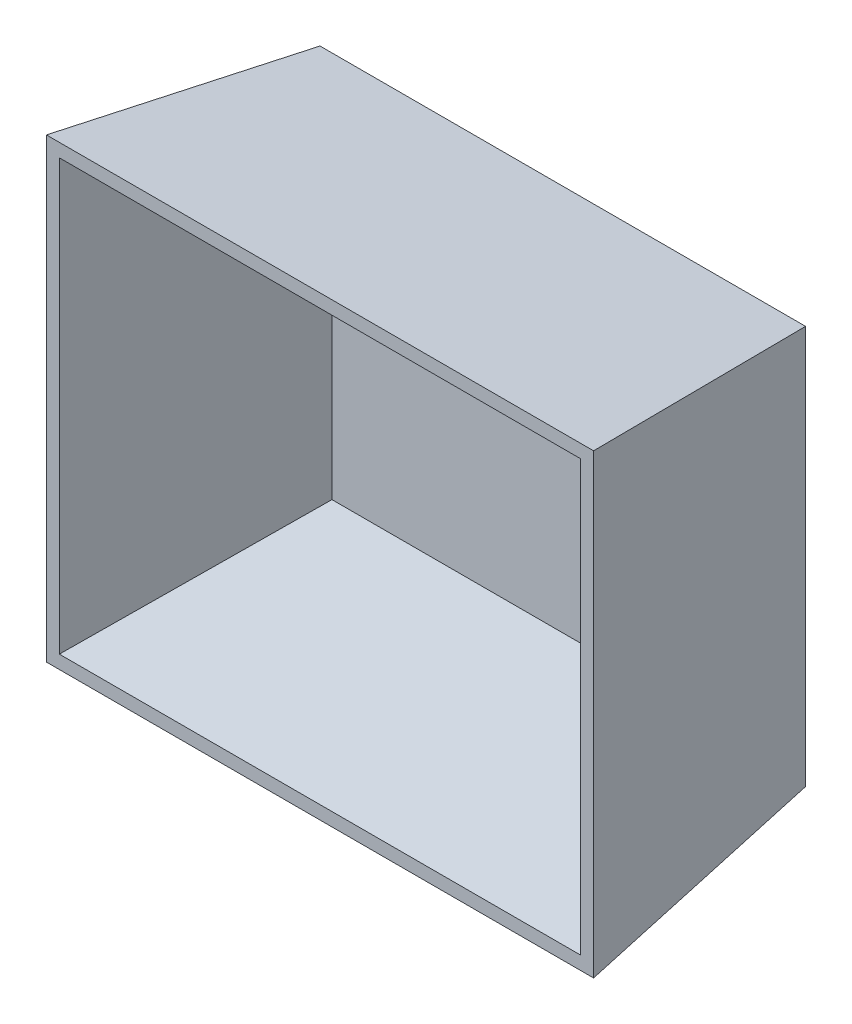
ISO-10303-21;
HEADER;
FILE_DESCRIPTION(('STEP AP214'),'2;1');
FILE_NAME('part.step','',(''),(''),'','','');
FILE_SCHEMA(('AUTOMOTIVE_DESIGN { 1 0 10303 214 1 1 1 1 }'));
ENDSEC;
DATA;
#1=APPLICATION_CONTEXT('core data for automotive mechanical design processes');
#2=APPLICATION_PROTOCOL_DEFINITION('international standard','automotive_design',2000,#1);
#3=PRODUCT_CONTEXT('',#1,'mechanical');
#4=PRODUCT('Part','Part','',(#3));
#5=PRODUCT_RELATED_PRODUCT_CATEGORY('part','',(#4));
#6=PRODUCT_DEFINITION_FORMATION('','',#4);
#7=PRODUCT_DEFINITION_CONTEXT('part definition',#1,'design');
#8=PRODUCT_DEFINITION('design','',#6,#7);
#9=PRODUCT_DEFINITION_SHAPE('','',#8);
#10=(LENGTH_UNIT() NAMED_UNIT(*) SI_UNIT(.MILLI.,.METRE.));
#11=(NAMED_UNIT(*) PLANE_ANGLE_UNIT() SI_UNIT($,.RADIAN.));
#12=(NAMED_UNIT(*) SI_UNIT($,.STERADIAN.) SOLID_ANGLE_UNIT());
#13=UNCERTAINTY_MEASURE_WITH_UNIT(LENGTH_MEASURE(1.E-05),#10,'distance_accuracy_value','');
#14=(GEOMETRIC_REPRESENTATION_CONTEXT(3) GLOBAL_UNCERTAINTY_ASSIGNED_CONTEXT((#13)) GLOBAL_UNIT_ASSIGNED_CONTEXT((#10,
#11,#12)) REPRESENTATION_CONTEXT('',''));
#15=CARTESIAN_POINT('',(0.,0.,0.));
#16=DIRECTION('',(0.,0.,1.));
#17=DIRECTION('',(1.,0.,0.));
#18=AXIS2_PLACEMENT_3D('',#15,#16,#17);
#19=CARTESIAN_POINT('',(0.,0.,67.));
#20=DIRECTION('',(0.,0.,-1.));
#21=DIRECTION('',(-1.,0.,0.));
#22=AXIS2_PLACEMENT_3D('',#19,#20,#21);
#23=PLANE('',#22);
#24=DIRECTION('',(0.,1.,0.));
#25=VECTOR('',#24,1.);
#26=CARTESIAN_POINT('',(142.5,-8.,67.));
#27=LINE('',#26,#25);
#28=CARTESIAN_POINT('',(142.5,-8.,67.));
#29=VERTEX_POINT('',#28);
#30=CARTESIAN_POINT('',(142.5,118.,67.));
#31=VERTEX_POINT('',#30);
#32=EDGE_CURVE('E312',#29,#31,#27,.T.);
#33=ORIENTED_EDGE('',*,*,#32,.T.);
#34=DIRECTION('',(-1.,0.,0.));
#35=VECTOR('',#34,1.);
#36=CARTESIAN_POINT('',(-8.50000000000001,118.,67.));
#37=LINE('',#36,#35);
#38=CARTESIAN_POINT('',(-8.50000000000001,118.,67.));
#39=VERTEX_POINT('',#38);
#40=EDGE_CURVE('E215',#31,#39,#37,.T.);
#41=ORIENTED_EDGE('',*,*,#40,.T.);
#42=DIRECTION('',(0.,-1.,0.));
#43=VECTOR('',#42,1.);
#44=CARTESIAN_POINT('',(-8.50000000000001,-7.99999999999997,67.));
#45=LINE('',#44,#43);
#46=CARTESIAN_POINT('',(-8.50000000000001,-7.99999999999997,67.));
#47=VERTEX_POINT('',#46);
#48=EDGE_CURVE('E200',#39,#47,#45,.T.);
#49=ORIENTED_EDGE('',*,*,#48,.T.);
#50=DIRECTION('',(1.,0.,0.));
#51=VECTOR('',#50,1.);
#52=CARTESIAN_POINT('',(-8.50000000000001,-7.99999999999997,67.));
#53=LINE('',#52,#51);
#54=EDGE_CURVE('E205',#47,#29,#53,.T.);
#55=ORIENTED_EDGE('',*,*,#54,.T.);
#56=EDGE_LOOP('',(#33,#41,#49,#55));
#57=FACE_BOUND('',#56,.T.);
#58=DIRECTION('',(0.,-1.,0.));
#59=VECTOR('',#58,1.);
#60=CARTESIAN_POINT('',(-4.93785539788666,-4.31363355955421,67.));
#61=LINE('',#60,#59);
#62=CARTESIAN_POINT('',(-4.93785539788666,114.313633559554,67.));
#63=VERTEX_POINT('',#62);
#64=CARTESIAN_POINT('',(-4.93785539788666,-4.31363355955421,67.));
#65=VERTEX_POINT('',#64);
#66=EDGE_CURVE('E139',#63,#65,#61,.T.);
#67=ORIENTED_EDGE('',*,*,#66,.F.);
#68=DIRECTION('',(-1.,0.,0.));
#69=VECTOR('',#68,1.);
#70=CARTESIAN_POINT('',(-4.93785539788666,114.313633559554,67.));
#71=LINE('',#70,#69);
#72=CARTESIAN_POINT('',(138.937855397887,114.313633559554,67.));
#73=VERTEX_POINT('',#72);
#74=EDGE_CURVE('E144',#73,#63,#71,.T.);
#75=ORIENTED_EDGE('',*,*,#74,.F.);
#76=DIRECTION('',(0.,1.,0.));
#77=VECTOR('',#76,1.);
#78=CARTESIAN_POINT('',(138.937855397887,-4.31363355955421,67.));
#79=LINE('',#78,#77);
#80=CARTESIAN_POINT('',(138.937855397887,-4.31363355955421,67.));
#81=VERTEX_POINT('',#80);
#82=EDGE_CURVE('E145',#81,#73,#79,.T.);
#83=ORIENTED_EDGE('',*,*,#82,.F.);
#84=DIRECTION('',(1.,0.,0.));
#85=VECTOR('',#84,1.);
#86=CARTESIAN_POINT('',(-4.93785539788666,-4.31363355955421,67.));
#87=LINE('',#86,#85);
#88=EDGE_CURVE('E129',#65,#81,#87,.T.);
#89=ORIENTED_EDGE('',*,*,#88,.F.);
#90=EDGE_LOOP('',(#67,#75,#83,#89));
#91=FACE_BOUND('',#90,.T.);
#92=ADVANCED_FACE('F55',(#57,#91),#23,.F.);
#93=CARTESIAN_POINT('',(0.,0.,0.));
#94=DIRECTION('',(0.,0.,-1.));
#95=DIRECTION('',(-1.,0.,0.));
#96=AXIS2_PLACEMENT_3D('',#93,#94,#95);
#97=PLANE('',#96);
#98=DIRECTION('',(0.,-1.,0.));
#99=VECTOR('',#98,1.);
#100=CARTESIAN_POINT('',(0.,0.,0.));
#101=LINE('',#100,#99);
#102=CARTESIAN_POINT('',(0.,110.,0.));
#103=VERTEX_POINT('',#102);
#104=CARTESIAN_POINT('',(0.,0.,0.));
#105=VERTEX_POINT('',#104);
#106=EDGE_CURVE('E170',#103,#105,#101,.T.);
#107=ORIENTED_EDGE('',*,*,#106,.F.);
#108=DIRECTION('',(-1.,0.,0.));
#109=VECTOR('',#108,1.);
#110=CARTESIAN_POINT('',(0.,110.,0.));
#111=LINE('',#110,#109);
#112=CARTESIAN_POINT('',(134.,110.,0.));
#113=VERTEX_POINT('',#112);
#114=EDGE_CURVE('E171',#113,#103,#111,.T.);
#115=ORIENTED_EDGE('',*,*,#114,.F.);
#116=DIRECTION('',(0.,1.,0.));
#117=VECTOR('',#116,1.);
#118=CARTESIAN_POINT('',(134.,0.,0.));
#119=LINE('',#118,#117);
#120=CARTESIAN_POINT('',(134.,0.,0.));
#121=VERTEX_POINT('',#120);
#122=EDGE_CURVE('E65',#121,#113,#119,.T.);
#123=ORIENTED_EDGE('',*,*,#122,.F.);
#124=DIRECTION('',(1.,0.,0.));
#125=VECTOR('',#124,1.);
#126=CARTESIAN_POINT('',(0.,0.,0.));
#127=LINE('',#126,#125);
#128=EDGE_CURVE('E12',#105,#121,#127,.T.);
#129=ORIENTED_EDGE('',*,*,#128,.F.);
#130=EDGE_LOOP('',(#107,#115,#123,#129));
#131=FACE_BOUND('',#130,.T.);
#132=ADVANCED_FACE('F57',(#131),#97,.T.);
#133=CARTESIAN_POINT('',(0.,108.4537667472,-12.9497034922029));
#134=DIRECTION('',(0.,0.992946793169428,-0.118560811124708));
#135=DIRECTION('',(0.,0.118560811124708,0.992946793169428));
#136=AXIS2_PLACEMENT_3D('',#133,#134,#135);
#137=PLANE('',#136);
#138=DIRECTION('',(-0.124983107879759,-0.11763116035742,-0.985160967993395));
#139=VECTOR('',#138,1.);
#140=CARTESIAN_POINT('',(142.5,118.,67.));
#141=LINE('',#140,#139);
#142=EDGE_CURVE('E192',#31,#113,#141,.T.);
#143=ORIENTED_EDGE('',*,*,#142,.T.);
#144=ORIENTED_EDGE('',*,*,#114,.T.);
#145=DIRECTION('',(0.124983107879759,-0.11763116035742,-0.985160967993395));
#146=VECTOR('',#145,1.);
#147=CARTESIAN_POINT('',(-8.50000000000001,118.,67.));
#148=LINE('',#147,#146);
#149=EDGE_CURVE('E189',#39,#103,#148,.T.);
#150=ORIENTED_EDGE('',*,*,#149,.F.);
#151=ORIENTED_EDGE('',*,*,#40,.F.);
#152=EDGE_LOOP('',(#143,#144,#150,#151));
#153=FACE_BOUND('',#152,.T.);
#154=ADVANCED_FACE('F188',(#153),#137,.T.);
#155=CARTESIAN_POINT('',(0.,0.,0.));
#156=DIRECTION('',(-0.992048408016277,0.,-0.125856887584155));
#157=DIRECTION('',(-0.125856887584155,0.,0.992048408016277));
#158=AXIS2_PLACEMENT_3D('',#155,#156,#157);
#159=PLANE('',#158);
#160=ORIENTED_EDGE('',*,*,#149,.T.);
#161=ORIENTED_EDGE('',*,*,#106,.T.);
#162=DIRECTION('',(0.124983107879759,0.11763116035742,-0.985160967993395));
#163=VECTOR('',#162,1.);
#164=CARTESIAN_POINT('',(-8.50000000000001,-7.99999999999997,67.));
#165=LINE('',#164,#163);
#166=EDGE_CURVE('E203',#47,#105,#165,.T.);
#167=ORIENTED_EDGE('',*,*,#166,.F.);
#168=ORIENTED_EDGE('',*,*,#48,.F.);
#169=EDGE_LOOP('',(#160,#161,#167,#168));
#170=FACE_BOUND('',#169,.T.);
#171=ADVANCED_FACE('F196',(#170),#159,.T.);
#172=CARTESIAN_POINT('',(131.877445875582,0.,-16.7307207454097));
#173=DIRECTION('',(0.992048408016277,0.,-0.125856887584154));
#174=DIRECTION('',(-0.125856887584154,0.,-0.992048408016277));
#175=AXIS2_PLACEMENT_3D('',#172,#173,#174);
#176=PLANE('',#175);
#177=DIRECTION('',(-0.124983107879759,0.11763116035742,-0.985160967993395));
#178=VECTOR('',#177,1.);
#179=CARTESIAN_POINT('',(142.5,-8.,67.));
#180=LINE('',#179,#178);
#181=EDGE_CURVE('E81',#29,#121,#180,.T.);
#182=ORIENTED_EDGE('',*,*,#181,.T.);
#183=ORIENTED_EDGE('',*,*,#122,.T.);
#184=ORIENTED_EDGE('',*,*,#142,.F.);
#185=ORIENTED_EDGE('',*,*,#32,.F.);
#186=EDGE_LOOP('',(#182,#183,#184,#185));
#187=FACE_BOUND('',#186,.T.);
#188=ADVANCED_FACE('F247',(#187),#176,.T.);
#189=CARTESIAN_POINT('',(0.,0.,0.));
#190=DIRECTION('',(0.,-0.992946793169428,-0.118560811124707));
#191=DIRECTION('',(0.,0.118560811124707,-0.992946793169428));
#192=AXIS2_PLACEMENT_3D('',#189,#190,#191);
#193=PLANE('',#192);
#194=ORIENTED_EDGE('',*,*,#166,.T.);
#195=ORIENTED_EDGE('',*,*,#128,.T.);
#196=ORIENTED_EDGE('',*,*,#181,.F.);
#197=ORIENTED_EDGE('',*,*,#54,.F.);
#198=EDGE_LOOP('',(#194,#195,#196,#197));
#199=FACE_BOUND('',#198,.T.);
#200=ADVANCED_FACE('F255',(#199),#193,.T.);
#201=CARTESIAN_POINT('',(0.,0.,1.));
#202=DIRECTION('',(0.,0.,1.));
#203=DIRECTION('',(1.,0.,0.));
#204=AXIS2_PLACEMENT_3D('',#201,#202,#203);
#205=PLANE('',#204);
#206=DIRECTION('',(0.,-1.,0.));
#207=VECTOR('',#206,1.);
#208=CARTESIAN_POINT('',(129.703615835821,105.768222272453,1.));
#209=LINE('',#208,#207);
#210=CARTESIAN_POINT('',(129.703615835821,105.768222272453,1.));
#211=VERTEX_POINT('',#210);
#212=CARTESIAN_POINT('',(129.703615835821,4.23177772754747,1.));
#213=VERTEX_POINT('',#212);
#214=EDGE_CURVE('E375',#211,#213,#209,.T.);
#215=ORIENTED_EDGE('',*,*,#214,.F.);
#216=DIRECTION('',(1.,0.,0.));
#217=VECTOR('',#216,1.);
#218=CARTESIAN_POINT('',(4.29638416417935,105.768222272453,1.));
#219=LINE('',#218,#217);
#220=CARTESIAN_POINT('',(4.29638416417935,105.768222272453,1.));
#221=VERTEX_POINT('',#220);
#222=EDGE_CURVE('E335',#221,#211,#219,.T.);
#223=ORIENTED_EDGE('',*,*,#222,.F.);
#224=DIRECTION('',(0.,1.,0.));
#225=VECTOR('',#224,1.);
#226=CARTESIAN_POINT('',(4.29638416417935,105.768222272453,1.));
#227=LINE('',#226,#225);
#228=CARTESIAN_POINT('',(4.29638416417935,4.23177772754747,0.999999999999987));
#229=VERTEX_POINT('',#228);
#230=EDGE_CURVE('E344',#229,#221,#227,.T.);
#231=ORIENTED_EDGE('',*,*,#230,.F.);
#232=DIRECTION('',(-1.,0.,0.));
#233=VECTOR('',#232,1.);
#234=CARTESIAN_POINT('',(4.29638416417935,4.23177772754747,1.));
#235=LINE('',#234,#233);
#236=EDGE_CURVE('E131',#213,#229,#235,.T.);
#237=ORIENTED_EDGE('',*,*,#236,.F.);
#238=EDGE_LOOP('',(#215,#223,#231,#237));
#239=FACE_BOUND('',#238,.T.);
#240=ADVANCED_FACE('F385',(#239),#205,.T.);
#241=CARTESIAN_POINT('',(4.35112120962661,0.,0.608777206261797));
#242=DIRECTION('',(0.99035361166143,0.,0.13856306820059));
#243=DIRECTION('',(0.13856306820059,0.,-0.99035361166143));
#244=AXIS2_PLACEMENT_3D('',#241,#242,#243);
#245=PLANE('',#244);
#246=DIRECTION('',(0.137437788371052,-0.127185613945401,-0.98231088456405));
#247=VECTOR('',#246,1.);
#248=CARTESIAN_POINT('',(-4.93785539788666,114.313633559554,67.));
#249=LINE('',#248,#247);
#250=EDGE_CURVE('E136',#63,#221,#249,.T.);
#251=ORIENTED_EDGE('',*,*,#250,.F.);
#252=ORIENTED_EDGE('',*,*,#66,.T.);
#253=DIRECTION('',(0.137437788371052,0.127185613945401,-0.98231088456405));
#254=VECTOR('',#253,1.);
#255=CARTESIAN_POINT('',(-4.93785539788666,-4.31363355955421,67.));
#256=LINE('',#255,#254);
#257=EDGE_CURVE('E125',#65,#229,#256,.T.);
#258=ORIENTED_EDGE('',*,*,#257,.T.);
#259=ORIENTED_EDGE('',*,*,#230,.T.);
#260=EDGE_LOOP('',(#251,#252,#258,#259));
#261=FACE_BOUND('',#260,.T.);
#262=ADVANCED_FACE('F140',(#261),#245,.T.);
#263=CARTESIAN_POINT('',(0.,4.28934697446635,0.555367182574245));
#264=DIRECTION('',(0.,0.991721928061714,0.128404117541285));
#265=DIRECTION('',(0.,-0.128404117541285,0.991721928061714));
#266=AXIS2_PLACEMENT_3D('',#263,#264,#265);
#267=PLANE('',#266);
#268=ORIENTED_EDGE('',*,*,#257,.F.);
#269=ORIENTED_EDGE('',*,*,#88,.T.);
#270=DIRECTION('',(-0.137437788371052,0.127185613945401,-0.98231088456405));
#271=VECTOR('',#270,1.);
#272=CARTESIAN_POINT('',(138.937855397887,-4.31363355955421,67.));
#273=LINE('',#272,#271);
#274=EDGE_CURVE('E73',#81,#213,#273,.T.);
#275=ORIENTED_EDGE('',*,*,#274,.T.);
#276=ORIENTED_EDGE('',*,*,#236,.T.);
#277=EDGE_LOOP('',(#268,#269,#275,#276));
#278=FACE_BOUND('',#277,.T.);
#279=ADVANCED_FACE('F127',(#278),#267,.T.);
#280=CARTESIAN_POINT('',(0.,103.897015111362,-13.4521625095274));
#281=DIRECTION('',(0.,-0.991721928061714,0.128404117541285));
#282=DIRECTION('',(0.,-0.128404117541285,-0.991721928061714));
#283=AXIS2_PLACEMENT_3D('',#280,#281,#282);
#284=PLANE('',#283);
#285=DIRECTION('',(-0.137437788371052,-0.127185613945401,-0.98231088456405));
#286=VECTOR('',#285,1.);
#287=CARTESIAN_POINT('',(138.937855397887,114.313633559554,67.));
#288=LINE('',#287,#286);
#289=EDGE_CURVE('E135',#73,#211,#288,.T.);
#290=ORIENTED_EDGE('',*,*,#289,.F.);
#291=ORIENTED_EDGE('',*,*,#74,.T.);
#292=ORIENTED_EDGE('',*,*,#250,.T.);
#293=ORIENTED_EDGE('',*,*,#222,.T.);
#294=EDGE_LOOP('',(#290,#291,#292,#293));
#295=FACE_BOUND('',#294,.T.);
#296=ADVANCED_FACE('F422',(#295),#284,.T.);
#297=CARTESIAN_POINT('',(127.076115791906,0.,-17.7795650884742));
#298=DIRECTION('',(-0.99035361166143,0.,0.13856306820059));
#299=DIRECTION('',(0.13856306820059,0.,0.99035361166143));
#300=AXIS2_PLACEMENT_3D('',#297,#298,#299);
#301=PLANE('',#300);
#302=ORIENTED_EDGE('',*,*,#274,.F.);
#303=ORIENTED_EDGE('',*,*,#82,.T.);
#304=ORIENTED_EDGE('',*,*,#289,.T.);
#305=ORIENTED_EDGE('',*,*,#214,.T.);
#306=EDGE_LOOP('',(#302,#303,#304,#305));
#307=FACE_BOUND('',#306,.T.);
#308=ADVANCED_FACE('F394',(#307),#301,.T.);
#309=CLOSED_SHELL('',(#92,#132,#154,#171,#188,#200,#240,#262,#279,#296,#308));
#310=MANIFOLD_SOLID_BREP('B2',#309);
#311=ADVANCED_BREP_SHAPE_REPRESENTATION('',(#18,#310),#14);
#312=SHAPE_DEFINITION_REPRESENTATION(#9,#311);
ENDSEC;
END-ISO-10303-21;
